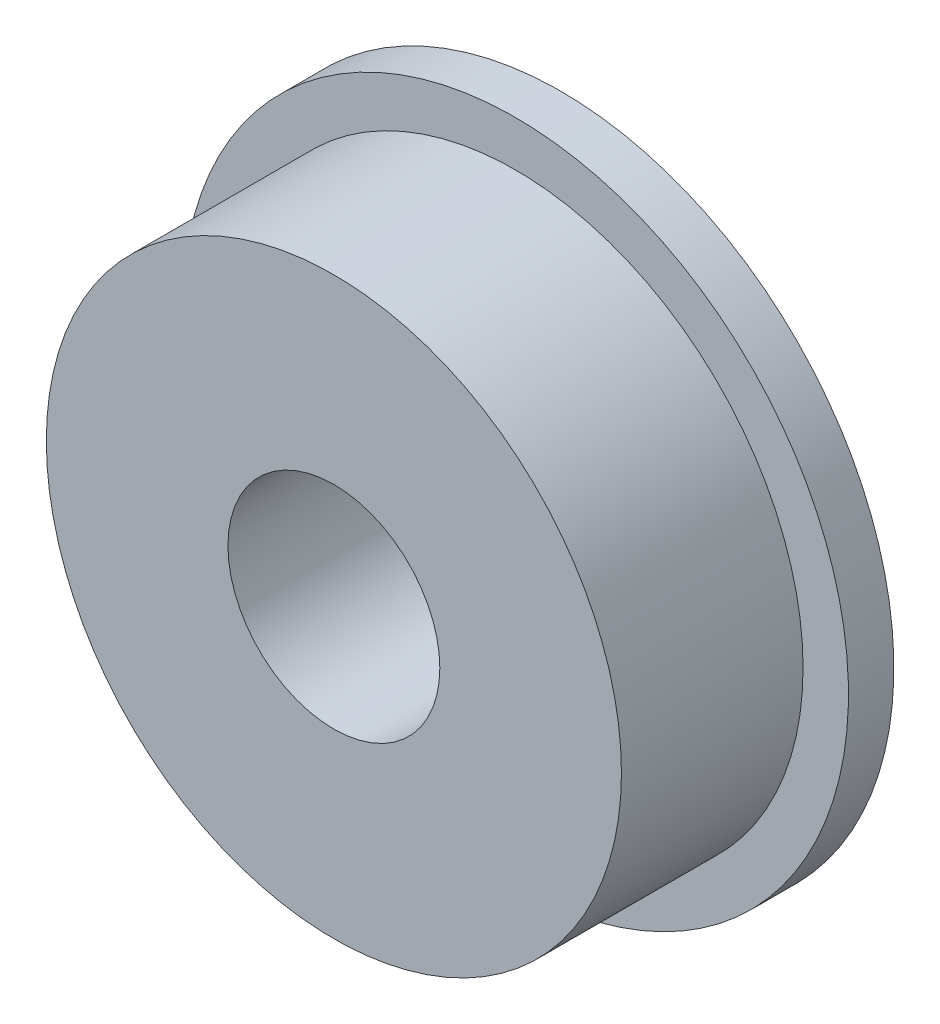
ISO-10303-21;
HEADER;
FILE_DESCRIPTION(('STEP AP214'),'2;1');
FILE_NAME('part.step','',(''),(''),'','','');
FILE_SCHEMA(('AUTOMOTIVE_DESIGN { 1 0 10303 214 1 1 1 1 }'));
ENDSEC;
DATA;
#1=APPLICATION_CONTEXT('core data for automotive mechanical design processes');
#2=APPLICATION_PROTOCOL_DEFINITION('international standard','automotive_design',2000,#1);
#3=PRODUCT_CONTEXT('',#1,'mechanical');
#4=PRODUCT('Part','Part','',(#3));
#5=PRODUCT_RELATED_PRODUCT_CATEGORY('part','',(#4));
#6=PRODUCT_DEFINITION_FORMATION('','',#4);
#7=PRODUCT_DEFINITION_CONTEXT('part definition',#1,'design');
#8=PRODUCT_DEFINITION('design','',#6,#7);
#9=PRODUCT_DEFINITION_SHAPE('','',#8);
#10=(LENGTH_UNIT() NAMED_UNIT(*) SI_UNIT(.MILLI.,.METRE.));
#11=(NAMED_UNIT(*) PLANE_ANGLE_UNIT() SI_UNIT($,.RADIAN.));
#12=(NAMED_UNIT(*) SI_UNIT($,.STERADIAN.) SOLID_ANGLE_UNIT());
#13=UNCERTAINTY_MEASURE_WITH_UNIT(LENGTH_MEASURE(1.E-05),#10,'distance_accuracy_value','');
#14=(GEOMETRIC_REPRESENTATION_CONTEXT(3) GLOBAL_UNCERTAINTY_ASSIGNED_CONTEXT((#13)) GLOBAL_UNIT_ASSIGNED_CONTEXT((#10,
#11,#12)) REPRESENTATION_CONTEXT('',''));
#15=CARTESIAN_POINT('',(0.,0.,0.));
#16=DIRECTION('',(0.,0.,1.));
#17=DIRECTION('',(1.,0.,0.));
#18=AXIS2_PLACEMENT_3D('',#15,#16,#17);
#19=CARTESIAN_POINT('',(0.,0.,6.));
#20=DIRECTION('',(0.,0.,1.));
#21=DIRECTION('',(1.,0.,0.));
#22=AXIS2_PLACEMENT_3D('',#19,#20,#21);
#23=PLANE('',#22);
#24=CARTESIAN_POINT('',(0.,0.,6.));
#25=DIRECTION('',(0.,0.,1.));
#26=DIRECTION('',(1.,0.,0.));
#27=AXIS2_PLACEMENT_3D('',#24,#25,#26);
#28=CIRCLE('',#27,9.5);
#29=CARTESIAN_POINT('',(9.5,0.,6.));
#30=VERTEX_POINT('',#29);
#31=EDGE_CURVE('E10',#30,#30,#28,.T.);
#32=ORIENTED_EDGE('',*,*,#31,.T.);
#33=EDGE_LOOP('',(#32));
#34=FACE_BOUND('',#33,.T.);
#35=CARTESIAN_POINT('',(0.,0.,6.));
#36=DIRECTION('',(0.,0.,1.));
#37=DIRECTION('',(1.,0.,0.));
#38=AXIS2_PLACEMENT_3D('',#35,#36,#37);
#39=CIRCLE('',#38,3.5);
#40=CARTESIAN_POINT('',(3.5,0.,6.));
#41=VERTEX_POINT('',#40);
#42=EDGE_CURVE('E39',#41,#41,#39,.T.);
#43=ORIENTED_EDGE('',*,*,#42,.F.);
#44=EDGE_LOOP('',(#43));
#45=FACE_BOUND('',#44,.T.);
#46=ADVANCED_FACE('F31',(#34,#45),#23,.T.);
#47=CARTESIAN_POINT('',(0.,0.,6.));
#48=DIRECTION('',(0.,0.,-1.));
#49=DIRECTION('',(-1.,0.,0.));
#50=AXIS2_PLACEMENT_3D('',#47,#48,#49);
#51=CYLINDRICAL_SURFACE('',#50,9.5);
#52=ORIENTED_EDGE('',*,*,#31,.F.);
#53=EDGE_LOOP('',(#52));
#54=FACE_BOUND('',#53,.T.);
#55=CARTESIAN_POINT('',(0.,0.,0.));
#56=DIRECTION('',(0.,0.,1.));
#57=DIRECTION('',(1.,0.,0.));
#58=AXIS2_PLACEMENT_3D('',#55,#56,#57);
#59=CIRCLE('',#58,9.5);
#60=CARTESIAN_POINT('',(9.5,0.,0.));
#61=VERTEX_POINT('',#60);
#62=EDGE_CURVE('E35',#61,#61,#59,.T.);
#63=ORIENTED_EDGE('',*,*,#62,.T.);
#64=EDGE_LOOP('',(#63));
#65=FACE_BOUND('',#64,.T.);
#66=ADVANCED_FACE('F33',(#54,#65),#51,.T.);
#67=CARTESIAN_POINT('',(0.,0.,6.));
#68=DIRECTION('',(0.,0.,-1.));
#69=DIRECTION('',(-1.,0.,0.));
#70=AXIS2_PLACEMENT_3D('',#67,#68,#69);
#71=CYLINDRICAL_SURFACE('',#70,3.5);
#72=ORIENTED_EDGE('',*,*,#42,.T.);
#73=EDGE_LOOP('',(#72));
#74=FACE_BOUND('',#73,.T.);
#75=CARTESIAN_POINT('',(0.,0.,-1.5));
#76=DIRECTION('',(0.,0.,-1.));
#77=DIRECTION('',(-1.,0.,0.));
#78=AXIS2_PLACEMENT_3D('',#75,#76,#77);
#79=CIRCLE('',#78,3.5);
#80=CARTESIAN_POINT('',(-3.5,0.,-1.5));
#81=VERTEX_POINT('',#80);
#82=EDGE_CURVE('E49',#81,#81,#79,.T.);
#83=ORIENTED_EDGE('',*,*,#82,.T.);
#84=EDGE_LOOP('',(#83));
#85=FACE_BOUND('',#84,.T.);
#86=ADVANCED_FACE('F55',(#74,#85),#71,.F.);
#87=CARTESIAN_POINT('',(0.,0.,-1.5));
#88=DIRECTION('',(0.,0.,-1.));
#89=DIRECTION('',(-1.,0.,0.));
#90=AXIS2_PLACEMENT_3D('',#87,#88,#89);
#91=PLANE('',#90);
#92=CARTESIAN_POINT('',(0.,0.,-1.5));
#93=DIRECTION('',(0.,0.,-1.));
#94=DIRECTION('',(-1.,0.,0.));
#95=AXIS2_PLACEMENT_3D('',#92,#93,#94);
#96=CIRCLE('',#95,11.);
#97=CARTESIAN_POINT('',(-11.,0.,-1.5));
#98=VERTEX_POINT('',#97);
#99=EDGE_CURVE('E48',#98,#98,#96,.T.);
#100=ORIENTED_EDGE('',*,*,#99,.T.);
#101=EDGE_LOOP('',(#100));
#102=FACE_BOUND('',#101,.T.);
#103=ORIENTED_EDGE('',*,*,#82,.F.);
#104=EDGE_LOOP('',(#103));
#105=FACE_BOUND('',#104,.T.);
#106=ADVANCED_FACE('F57',(#102,#105),#91,.T.);
#107=CARTESIAN_POINT('',(0.,0.,0.));
#108=DIRECTION('',(0.,0.,-1.));
#109=DIRECTION('',(-1.,0.,0.));
#110=AXIS2_PLACEMENT_3D('',#107,#108,#109);
#111=PLANE('',#110);
#112=ORIENTED_EDGE('',*,*,#62,.F.);
#113=EDGE_LOOP('',(#112));
#114=FACE_BOUND('',#113,.T.);
#115=CARTESIAN_POINT('',(0.,0.,0.));
#116=DIRECTION('',(0.,0.,-1.));
#117=DIRECTION('',(-1.,0.,0.));
#118=AXIS2_PLACEMENT_3D('',#115,#116,#117);
#119=CIRCLE('',#118,11.);
#120=CARTESIAN_POINT('',(-11.,0.,0.));
#121=VERTEX_POINT('',#120);
#122=EDGE_CURVE('E45',#121,#121,#119,.T.);
#123=ORIENTED_EDGE('',*,*,#122,.F.);
#124=EDGE_LOOP('',(#123));
#125=FACE_BOUND('',#124,.T.);
#126=ADVANCED_FACE('F59',(#114,#125),#111,.F.);
#127=CARTESIAN_POINT('',(0.,0.,-1.5));
#128=DIRECTION('',(0.,0.,1.));
#129=DIRECTION('',(1.,0.,0.));
#130=AXIS2_PLACEMENT_3D('',#127,#128,#129);
#131=CYLINDRICAL_SURFACE('',#130,11.);
#132=ORIENTED_EDGE('',*,*,#99,.F.);
#133=EDGE_LOOP('',(#132));
#134=FACE_BOUND('',#133,.T.);
#135=ORIENTED_EDGE('',*,*,#122,.T.);
#136=EDGE_LOOP('',(#135));
#137=FACE_BOUND('',#136,.T.);
#138=ADVANCED_FACE('F66',(#134,#137),#131,.T.);
#139=CLOSED_SHELL('',(#46,#66,#86,#106,#126,#138));
#140=MANIFOLD_SOLID_BREP('B2',#139);
#141=ADVANCED_BREP_SHAPE_REPRESENTATION('',(#18,#140),#14);
#142=SHAPE_DEFINITION_REPRESENTATION(#9,#141);
ENDSEC;
END-ISO-10303-21;
